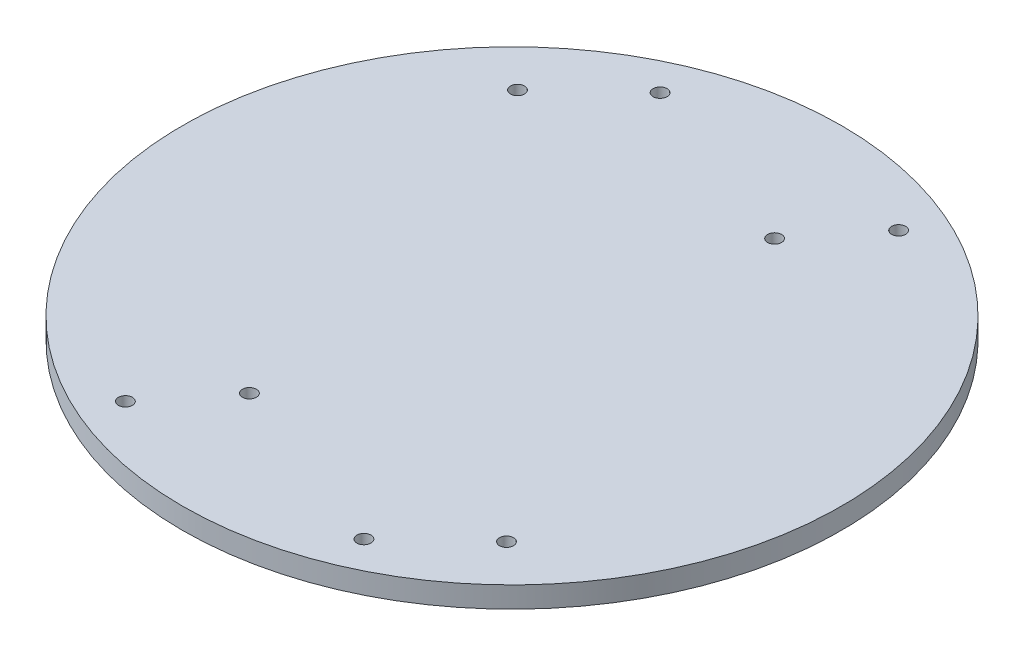
ISO-10303-21;
HEADER;
FILE_DESCRIPTION(('STEP AP214'),'2;1');
FILE_NAME('part.step','',(''),(''),'','','');
FILE_SCHEMA(('AUTOMOTIVE_DESIGN { 1 0 10303 214 1 1 1 1 }'));
ENDSEC;
DATA;
#1=APPLICATION_CONTEXT('core data for automotive mechanical design processes');
#2=APPLICATION_PROTOCOL_DEFINITION('international standard','automotive_design',2000,#1);
#3=PRODUCT_CONTEXT('',#1,'mechanical');
#4=PRODUCT('Part','Part','',(#3));
#5=PRODUCT_RELATED_PRODUCT_CATEGORY('part','',(#4));
#6=PRODUCT_DEFINITION_FORMATION('','',#4);
#7=PRODUCT_DEFINITION_CONTEXT('part definition',#1,'design');
#8=PRODUCT_DEFINITION('design','',#6,#7);
#9=PRODUCT_DEFINITION_SHAPE('','',#8);
#10=(LENGTH_UNIT() NAMED_UNIT(*) SI_UNIT(.MILLI.,.METRE.));
#11=(NAMED_UNIT(*) PLANE_ANGLE_UNIT() SI_UNIT($,.RADIAN.));
#12=(NAMED_UNIT(*) SI_UNIT($,.STERADIAN.) SOLID_ANGLE_UNIT());
#13=UNCERTAINTY_MEASURE_WITH_UNIT(LENGTH_MEASURE(1.E-05),#10,'distance_accuracy_value','');
#14=(GEOMETRIC_REPRESENTATION_CONTEXT(3) GLOBAL_UNCERTAINTY_ASSIGNED_CONTEXT((#13)) GLOBAL_UNIT_ASSIGNED_CONTEXT((#10,
#11,#12)) REPRESENTATION_CONTEXT('',''));
#15=CARTESIAN_POINT('',(0.,0.,0.));
#16=DIRECTION('',(0.,0.,1.));
#17=DIRECTION('',(1.,0.,0.));
#18=AXIS2_PLACEMENT_3D('',#15,#16,#17);
#19=CARTESIAN_POINT('',(0.,1.5,0.));
#20=DIRECTION('',(0.,-1.,0.));
#21=DIRECTION('',(0.,0.,-1.));
#22=AXIS2_PLACEMENT_3D('',#19,#20,#21);
#23=CYLINDRICAL_SURFACE('',#22,47.);
#24=CARTESIAN_POINT('',(0.,1.5,0.));
#25=DIRECTION('',(0.,1.,0.));
#26=DIRECTION('',(0.,0.,1.));
#27=AXIS2_PLACEMENT_3D('',#24,#25,#26);
#28=CIRCLE('',#27,47.);
#29=CARTESIAN_POINT('',(0.,1.5,47.));
#30=VERTEX_POINT('',#29);
#31=EDGE_CURVE('E10',#30,#30,#28,.T.);
#32=ORIENTED_EDGE('',*,*,#31,.F.);
#33=EDGE_LOOP('',(#32));
#34=FACE_BOUND('',#33,.T.);
#35=CARTESIAN_POINT('',(0.,-1.5,0.));
#36=DIRECTION('',(0.,1.,0.));
#37=DIRECTION('',(0.,0.,1.));
#38=AXIS2_PLACEMENT_3D('',#35,#36,#37);
#39=CIRCLE('',#38,47.);
#40=CARTESIAN_POINT('',(0.,-1.5,47.));
#41=VERTEX_POINT('',#40);
#42=EDGE_CURVE('E35',#41,#41,#39,.T.);
#43=ORIENTED_EDGE('',*,*,#42,.T.);
#44=EDGE_LOOP('',(#43));
#45=FACE_BOUND('',#44,.T.);
#46=ADVANCED_FACE('F32',(#34,#45),#23,.T.);
#47=CARTESIAN_POINT('',(0.,1.5,0.));
#48=DIRECTION('',(0.,1.,0.));
#49=DIRECTION('',(0.,0.,1.));
#50=AXIS2_PLACEMENT_3D('',#47,#48,#49);
#51=PLANE('',#50);
#52=CARTESIAN_POINT('',(-17.0092592584861,1.5,38.1280421668568));
#53=DIRECTION('',(0.,1.,0.));
#54=DIRECTION('',(0.,0.,-1.));
#55=AXIS2_PLACEMENT_3D('',#52,#53,#54);
#56=CIRCLE('',#55,1.);
#57=CARTESIAN_POINT('',(-17.0092592584861,1.5,37.1280421668568));
#58=VERTEX_POINT('',#57);
#59=EDGE_CURVE('E86',#58,#58,#56,.T.);
#60=ORIENTED_EDGE('',*,*,#59,.F.);
#61=EDGE_LOOP('',(#60));
#62=FACE_BOUND('',#61,.T.);
#63=CARTESIAN_POINT('',(-17.009259258486,1.5,-38.1280421668568));
#64=DIRECTION('',(0.,1.,0.));
#65=DIRECTION('',(0.,0.,1.));
#66=AXIS2_PLACEMENT_3D('',#63,#64,#65);
#67=CIRCLE('',#66,1.);
#68=CARTESIAN_POINT('',(-17.009259258486,1.5,-37.1280421668568));
#69=VERTEX_POINT('',#68);
#70=EDGE_CURVE('E80',#69,#69,#67,.T.);
#71=ORIENTED_EDGE('',*,*,#70,.F.);
#72=EDGE_LOOP('',(#71));
#73=FACE_BOUND('',#72,.T.);
#74=CARTESIAN_POINT('',(17.009259258486,1.5,-38.1280421668568));
#75=DIRECTION('',(0.,1.,0.));
#76=DIRECTION('',(0.,0.,-1.));
#77=AXIS2_PLACEMENT_3D('',#74,#75,#76);
#78=CIRCLE('',#77,1.);
#79=CARTESIAN_POINT('',(17.009259258486,1.5,-39.1280421668568));
#80=VERTEX_POINT('',#79);
#81=EDGE_CURVE('E74',#80,#80,#78,.T.);
#82=ORIENTED_EDGE('',*,*,#81,.F.);
#83=EDGE_LOOP('',(#82));
#84=FACE_BOUND('',#83,.T.);
#85=CARTESIAN_POINT('',(17.0092592584861,1.5,38.1280421668568));
#86=DIRECTION('',(0.,1.,0.));
#87=DIRECTION('',(0.,0.,1.));
#88=AXIS2_PLACEMENT_3D('',#85,#86,#87);
#89=CIRCLE('',#88,1.);
#90=CARTESIAN_POINT('',(17.0092592584861,1.5,39.1280421668568));
#91=VERTEX_POINT('',#90);
#92=EDGE_CURVE('E68',#91,#91,#89,.T.);
#93=ORIENTED_EDGE('',*,*,#92,.F.);
#94=EDGE_LOOP('',(#93));
#95=FACE_BOUND('',#94,.T.);
#96=CARTESIAN_POINT('',(-27.4999999999999,1.5,-28.2842712474619));
#97=DIRECTION('',(0.,1.,0.));
#98=DIRECTION('',(0.,0.,1.));
#99=AXIS2_PLACEMENT_3D('',#96,#97,#98);
#100=CIRCLE('',#99,1.);
#101=CARTESIAN_POINT('',(-27.4999999999999,1.5,-27.2842712474619));
#102=VERTEX_POINT('',#101);
#103=EDGE_CURVE('E62',#102,#102,#100,.T.);
#104=ORIENTED_EDGE('',*,*,#103,.F.);
#105=EDGE_LOOP('',(#104));
#106=FACE_BOUND('',#105,.T.);
#107=CARTESIAN_POINT('',(-9.16666666499999,1.5,28.2842712474619));
#108=DIRECTION('',(0.,1.,0.));
#109=DIRECTION('',(0.,0.,1.));
#110=AXIS2_PLACEMENT_3D('',#107,#108,#109);
#111=CIRCLE('',#110,1.);
#112=CARTESIAN_POINT('',(-9.16666666499999,1.5,29.2842712474619));
#113=VERTEX_POINT('',#112);
#114=EDGE_CURVE('E56',#113,#113,#111,.T.);
#115=ORIENTED_EDGE('',*,*,#114,.F.);
#116=EDGE_LOOP('',(#115));
#117=FACE_BOUND('',#116,.T.);
#118=CARTESIAN_POINT('',(9.16666666499999,1.5,-28.2842712474619));
#119=DIRECTION('',(0.,1.,0.));
#120=DIRECTION('',(0.,0.,1.));
#121=AXIS2_PLACEMENT_3D('',#118,#119,#120);
#122=CIRCLE('',#121,1.);
#123=CARTESIAN_POINT('',(9.16666666499999,1.5,-27.2842712474619));
#124=VERTEX_POINT('',#123);
#125=EDGE_CURVE('E50',#124,#124,#122,.T.);
#126=ORIENTED_EDGE('',*,*,#125,.F.);
#127=EDGE_LOOP('',(#126));
#128=FACE_BOUND('',#127,.T.);
#129=CARTESIAN_POINT('',(27.4999999999999,1.5,28.2842712474619));
#130=DIRECTION('',(0.,1.,0.));
#131=DIRECTION('',(0.,0.,1.));
#132=AXIS2_PLACEMENT_3D('',#129,#130,#131);
#133=CIRCLE('',#132,0.999999999999987);
#134=CARTESIAN_POINT('',(27.4999999999999,1.5,29.2842712474619));
#135=VERTEX_POINT('',#134);
#136=EDGE_CURVE('E44',#135,#135,#133,.T.);
#137=ORIENTED_EDGE('',*,*,#136,.F.);
#138=EDGE_LOOP('',(#137));
#139=FACE_BOUND('',#138,.T.);
#140=ORIENTED_EDGE('',*,*,#31,.T.);
#141=EDGE_LOOP('',(#140));
#142=FACE_BOUND('',#141,.T.);
#143=ADVANCED_FACE('F102',(#62,#73,#84,#95,#106,#117,#128,#139,#142),#51,.T.);
#144=CARTESIAN_POINT('',(0.,-1.5,0.));
#145=DIRECTION('',(0.,1.,0.));
#146=DIRECTION('',(0.,0.,1.));
#147=AXIS2_PLACEMENT_3D('',#144,#145,#146);
#148=PLANE('',#147);
#149=CARTESIAN_POINT('',(-17.0092592584861,-1.5,38.1280421668568));
#150=DIRECTION('',(0.,1.,0.));
#151=DIRECTION('',(0.,0.,-1.));
#152=AXIS2_PLACEMENT_3D('',#149,#150,#151);
#153=CIRCLE('',#152,1.);
#154=CARTESIAN_POINT('',(-17.0092592584861,-1.5,37.1280421668568));
#155=VERTEX_POINT('',#154);
#156=EDGE_CURVE('E83',#155,#155,#153,.T.);
#157=ORIENTED_EDGE('',*,*,#156,.T.);
#158=EDGE_LOOP('',(#157));
#159=FACE_BOUND('',#158,.T.);
#160=CARTESIAN_POINT('',(-17.009259258486,-1.5,-38.1280421668568));
#161=DIRECTION('',(0.,1.,0.));
#162=DIRECTION('',(0.,0.,1.));
#163=AXIS2_PLACEMENT_3D('',#160,#161,#162);
#164=CIRCLE('',#163,1.);
#165=CARTESIAN_POINT('',(-17.009259258486,-1.5,-37.1280421668568));
#166=VERTEX_POINT('',#165);
#167=EDGE_CURVE('E77',#166,#166,#164,.T.);
#168=ORIENTED_EDGE('',*,*,#167,.T.);
#169=EDGE_LOOP('',(#168));
#170=FACE_BOUND('',#169,.T.);
#171=CARTESIAN_POINT('',(17.009259258486,-1.5,-38.1280421668568));
#172=DIRECTION('',(0.,1.,0.));
#173=DIRECTION('',(0.,0.,-1.));
#174=AXIS2_PLACEMENT_3D('',#171,#172,#173);
#175=CIRCLE('',#174,1.);
#176=CARTESIAN_POINT('',(17.009259258486,-1.5,-39.1280421668568));
#177=VERTEX_POINT('',#176);
#178=EDGE_CURVE('E71',#177,#177,#175,.T.);
#179=ORIENTED_EDGE('',*,*,#178,.T.);
#180=EDGE_LOOP('',(#179));
#181=FACE_BOUND('',#180,.T.);
#182=CARTESIAN_POINT('',(17.0092592584861,-1.5,38.1280421668568));
#183=DIRECTION('',(0.,1.,0.));
#184=DIRECTION('',(0.,0.,1.));
#185=AXIS2_PLACEMENT_3D('',#182,#183,#184);
#186=CIRCLE('',#185,1.);
#187=CARTESIAN_POINT('',(17.0092592584861,-1.5,39.1280421668568));
#188=VERTEX_POINT('',#187);
#189=EDGE_CURVE('E65',#188,#188,#186,.T.);
#190=ORIENTED_EDGE('',*,*,#189,.T.);
#191=EDGE_LOOP('',(#190));
#192=FACE_BOUND('',#191,.T.);
#193=CARTESIAN_POINT('',(-27.4999999999999,-1.5,-28.2842712474619));
#194=DIRECTION('',(0.,1.,0.));
#195=DIRECTION('',(0.,0.,1.));
#196=AXIS2_PLACEMENT_3D('',#193,#194,#195);
#197=CIRCLE('',#196,1.);
#198=CARTESIAN_POINT('',(-27.4999999999999,-1.5,-27.2842712474619));
#199=VERTEX_POINT('',#198);
#200=EDGE_CURVE('E59',#199,#199,#197,.T.);
#201=ORIENTED_EDGE('',*,*,#200,.T.);
#202=EDGE_LOOP('',(#201));
#203=FACE_BOUND('',#202,.T.);
#204=CARTESIAN_POINT('',(-9.16666666499999,-1.5,28.2842712474619));
#205=DIRECTION('',(0.,1.,0.));
#206=DIRECTION('',(0.,0.,1.));
#207=AXIS2_PLACEMENT_3D('',#204,#205,#206);
#208=CIRCLE('',#207,1.);
#209=CARTESIAN_POINT('',(-9.16666666499999,-1.5,29.2842712474619));
#210=VERTEX_POINT('',#209);
#211=EDGE_CURVE('E53',#210,#210,#208,.T.);
#212=ORIENTED_EDGE('',*,*,#211,.T.);
#213=EDGE_LOOP('',(#212));
#214=FACE_BOUND('',#213,.T.);
#215=CARTESIAN_POINT('',(9.16666666499999,-1.5,-28.2842712474619));
#216=DIRECTION('',(0.,1.,0.));
#217=DIRECTION('',(0.,0.,1.));
#218=AXIS2_PLACEMENT_3D('',#215,#216,#217);
#219=CIRCLE('',#218,1.);
#220=CARTESIAN_POINT('',(9.16666666499999,-1.5,-27.2842712474619));
#221=VERTEX_POINT('',#220);
#222=EDGE_CURVE('E47',#221,#221,#219,.T.);
#223=ORIENTED_EDGE('',*,*,#222,.T.);
#224=EDGE_LOOP('',(#223));
#225=FACE_BOUND('',#224,.T.);
#226=CARTESIAN_POINT('',(27.4999999999999,-1.5,28.2842712474619));
#227=DIRECTION('',(0.,1.,0.));
#228=DIRECTION('',(0.,0.,1.));
#229=AXIS2_PLACEMENT_3D('',#226,#227,#228);
#230=CIRCLE('',#229,0.999999999999987);
#231=CARTESIAN_POINT('',(27.4999999999999,-1.5,29.2842712474619));
#232=VERTEX_POINT('',#231);
#233=EDGE_CURVE('E42',#232,#232,#230,.T.);
#234=ORIENTED_EDGE('',*,*,#233,.T.);
#235=EDGE_LOOP('',(#234));
#236=FACE_BOUND('',#235,.T.);
#237=ORIENTED_EDGE('',*,*,#42,.F.);
#238=EDGE_LOOP('',(#237));
#239=FACE_BOUND('',#238,.T.);
#240=ADVANCED_FACE('F92',(#159,#170,#181,#192,#203,#214,#225,#236,#239),#148,.F.);
#241=CARTESIAN_POINT('',(27.4999999999999,-1.5,28.2842712474619));
#242=DIRECTION('',(0.,1.,0.));
#243=DIRECTION('',(0.,0.,1.));
#244=AXIS2_PLACEMENT_3D('',#241,#242,#243);
#245=CYLINDRICAL_SURFACE('',#244,0.999999999999987);
#246=ORIENTED_EDGE('',*,*,#233,.F.);
#247=EDGE_LOOP('',(#246));
#248=FACE_BOUND('',#247,.T.);
#249=ORIENTED_EDGE('',*,*,#136,.T.);
#250=EDGE_LOOP('',(#249));
#251=FACE_BOUND('',#250,.T.);
#252=ADVANCED_FACE('F120',(#248,#251),#245,.F.);
#253=CARTESIAN_POINT('',(9.16666666499999,-1.5,-28.2842712474619));
#254=DIRECTION('',(0.,1.,0.));
#255=DIRECTION('',(0.,0.,1.));
#256=AXIS2_PLACEMENT_3D('',#253,#254,#255);
#257=CYLINDRICAL_SURFACE('',#256,1.);
#258=ORIENTED_EDGE('',*,*,#222,.F.);
#259=EDGE_LOOP('',(#258));
#260=FACE_BOUND('',#259,.T.);
#261=ORIENTED_EDGE('',*,*,#125,.T.);
#262=EDGE_LOOP('',(#261));
#263=FACE_BOUND('',#262,.T.);
#264=ADVANCED_FACE('F122',(#260,#263),#257,.F.);
#265=CARTESIAN_POINT('',(-9.16666666499999,-1.5,28.2842712474619));
#266=DIRECTION('',(0.,1.,0.));
#267=DIRECTION('',(0.,0.,1.));
#268=AXIS2_PLACEMENT_3D('',#265,#266,#267);
#269=CYLINDRICAL_SURFACE('',#268,1.);
#270=ORIENTED_EDGE('',*,*,#211,.F.);
#271=EDGE_LOOP('',(#270));
#272=FACE_BOUND('',#271,.T.);
#273=ORIENTED_EDGE('',*,*,#114,.T.);
#274=EDGE_LOOP('',(#273));
#275=FACE_BOUND('',#274,.T.);
#276=ADVANCED_FACE('F129',(#272,#275),#269,.F.);
#277=CARTESIAN_POINT('',(-27.4999999999999,-1.5,-28.2842712474619));
#278=DIRECTION('',(0.,1.,0.));
#279=DIRECTION('',(0.,0.,1.));
#280=AXIS2_PLACEMENT_3D('',#277,#278,#279);
#281=CYLINDRICAL_SURFACE('',#280,1.);
#282=ORIENTED_EDGE('',*,*,#200,.F.);
#283=EDGE_LOOP('',(#282));
#284=FACE_BOUND('',#283,.T.);
#285=ORIENTED_EDGE('',*,*,#103,.T.);
#286=EDGE_LOOP('',(#285));
#287=FACE_BOUND('',#286,.T.);
#288=ADVANCED_FACE('F167',(#284,#287),#281,.F.);
#289=CARTESIAN_POINT('',(17.0092592584861,-1.5,38.1280421668568));
#290=DIRECTION('',(0.,1.,0.));
#291=DIRECTION('',(0.,0.,1.));
#292=AXIS2_PLACEMENT_3D('',#289,#290,#291);
#293=CYLINDRICAL_SURFACE('',#292,1.);
#294=ORIENTED_EDGE('',*,*,#189,.F.);
#295=EDGE_LOOP('',(#294));
#296=FACE_BOUND('',#295,.T.);
#297=ORIENTED_EDGE('',*,*,#92,.T.);
#298=EDGE_LOOP('',(#297));
#299=FACE_BOUND('',#298,.T.);
#300=ADVANCED_FACE('F177',(#296,#299),#293,.F.);
#301=CARTESIAN_POINT('',(17.009259258486,-1.5,-38.1280421668568));
#302=DIRECTION('',(0.,1.,0.));
#303=DIRECTION('',(0.,0.,1.));
#304=AXIS2_PLACEMENT_3D('',#301,#302,#303);
#305=CYLINDRICAL_SURFACE('',#304,1.);
#306=ORIENTED_EDGE('',*,*,#178,.F.);
#307=EDGE_LOOP('',(#306));
#308=FACE_BOUND('',#307,.T.);
#309=ORIENTED_EDGE('',*,*,#81,.T.);
#310=EDGE_LOOP('',(#309));
#311=FACE_BOUND('',#310,.T.);
#312=ADVANCED_FACE('F187',(#308,#311),#305,.F.);
#313=CARTESIAN_POINT('',(-17.009259258486,-1.5,-38.1280421668568));
#314=DIRECTION('',(0.,1.,0.));
#315=DIRECTION('',(0.,0.,1.));
#316=AXIS2_PLACEMENT_3D('',#313,#314,#315);
#317=CYLINDRICAL_SURFACE('',#316,1.);
#318=ORIENTED_EDGE('',*,*,#167,.F.);
#319=EDGE_LOOP('',(#318));
#320=FACE_BOUND('',#319,.T.);
#321=ORIENTED_EDGE('',*,*,#70,.T.);
#322=EDGE_LOOP('',(#321));
#323=FACE_BOUND('',#322,.T.);
#324=ADVANCED_FACE('F98',(#320,#323),#317,.F.);
#325=CARTESIAN_POINT('',(-17.0092592584861,-1.5,38.1280421668568));
#326=DIRECTION('',(0.,1.,0.));
#327=DIRECTION('',(0.,0.,1.));
#328=AXIS2_PLACEMENT_3D('',#325,#326,#327);
#329=CYLINDRICAL_SURFACE('',#328,1.);
#330=ORIENTED_EDGE('',*,*,#156,.F.);
#331=EDGE_LOOP('',(#330));
#332=FACE_BOUND('',#331,.T.);
#333=ORIENTED_EDGE('',*,*,#59,.T.);
#334=EDGE_LOOP('',(#333));
#335=FACE_BOUND('',#334,.T.);
#336=ADVANCED_FACE('F95',(#332,#335),#329,.F.);
#337=CLOSED_SHELL('',(#46,#143,#240,#252,#264,#276,#288,#300,#312,#324,#336));
#338=MANIFOLD_SOLID_BREP('B2',#337);
#339=ADVANCED_BREP_SHAPE_REPRESENTATION('',(#18,#338),#14);
#340=SHAPE_DEFINITION_REPRESENTATION(#9,#339);
ENDSEC;
END-ISO-10303-21;
